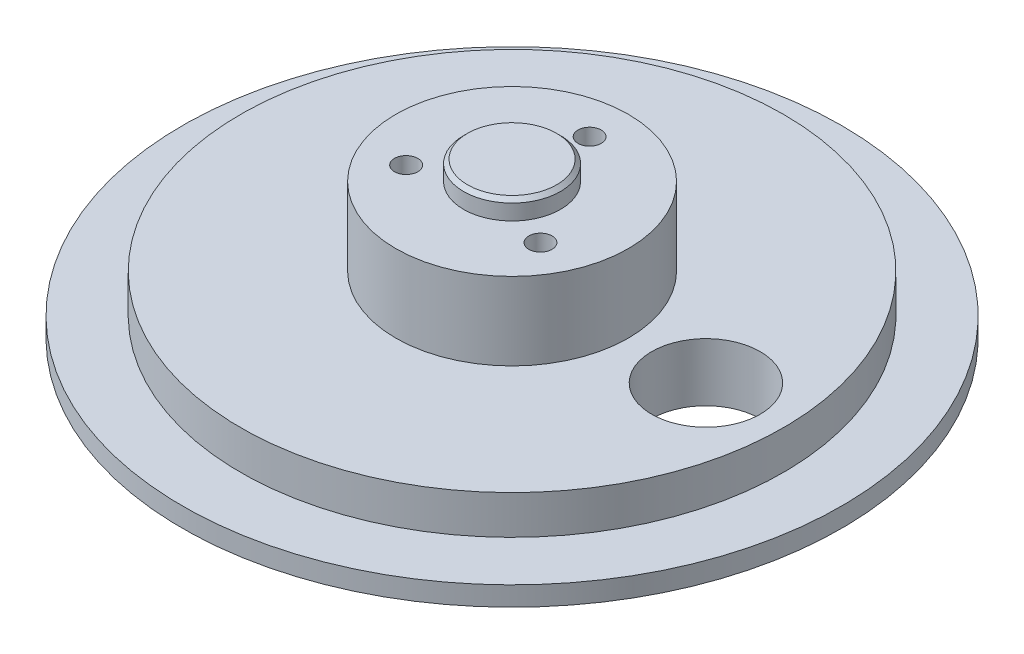
ISO-10303-21;
HEADER;
FILE_DESCRIPTION(('STEP AP214'),'2;1');
FILE_NAME('part.step','',(''),(''),'','','');
FILE_SCHEMA(('AUTOMOTIVE_DESIGN { 1 0 10303 214 1 1 1 1 }'));
ENDSEC;
DATA;
#1=APPLICATION_CONTEXT('core data for automotive mechanical design processes');
#2=APPLICATION_PROTOCOL_DEFINITION('international standard','automotive_design',2000,#1);
#3=PRODUCT_CONTEXT('',#1,'mechanical');
#4=PRODUCT('Part','Part','',(#3));
#5=PRODUCT_RELATED_PRODUCT_CATEGORY('part','',(#4));
#6=PRODUCT_DEFINITION_FORMATION('','',#4);
#7=PRODUCT_DEFINITION_CONTEXT('part definition',#1,'design');
#8=PRODUCT_DEFINITION('design','',#6,#7);
#9=PRODUCT_DEFINITION_SHAPE('','',#8);
#10=(LENGTH_UNIT() NAMED_UNIT(*) SI_UNIT(.MILLI.,.METRE.));
#11=(NAMED_UNIT(*) PLANE_ANGLE_UNIT() SI_UNIT($,.RADIAN.));
#12=(NAMED_UNIT(*) SI_UNIT($,.STERADIAN.) SOLID_ANGLE_UNIT());
#13=UNCERTAINTY_MEASURE_WITH_UNIT(LENGTH_MEASURE(1.E-05),#10,'distance_accuracy_value','');
#14=(GEOMETRIC_REPRESENTATION_CONTEXT(3) GLOBAL_UNCERTAINTY_ASSIGNED_CONTEXT((#13)) GLOBAL_UNIT_ASSIGNED_CONTEXT((#10,
#11,#12)) REPRESENTATION_CONTEXT('',''));
#15=CARTESIAN_POINT('',(0.,0.,0.));
#16=DIRECTION('',(0.,0.,1.));
#17=DIRECTION('',(1.,0.,0.));
#18=AXIS2_PLACEMENT_3D('',#15,#16,#17);
#19=CARTESIAN_POINT('',(0.,35.,0.));
#20=DIRECTION('',(0.,1.,0.));
#21=DIRECTION('',(0.,0.,1.));
#22=AXIS2_PLACEMENT_3D('',#19,#20,#21);
#23=PLANE('',#22);
#24=CARTESIAN_POINT('',(-17.3205080756879,35.,10.0000000000005));
#25=DIRECTION('',(0.,1.,0.));
#26=DIRECTION('',(0.,0.,1.));
#27=AXIS2_PLACEMENT_3D('',#24,#25,#26);
#28=CIRCLE('',#27,3.00000000000113);
#29=CARTESIAN_POINT('',(-17.3205080756879,35.,13.0000000000016));
#30=VERTEX_POINT('',#29);
#31=EDGE_CURVE('E86',#30,#30,#28,.T.);
#32=ORIENTED_EDGE('',*,*,#31,.F.);
#33=EDGE_LOOP('',(#32));
#34=FACE_BOUND('',#33,.T.);
#35=CARTESIAN_POINT('',(17.3205080756896,35.,9.99999999999951));
#36=DIRECTION('',(0.,1.,0.));
#37=DIRECTION('',(0.,0.,1.));
#38=AXIS2_PLACEMENT_3D('',#35,#36,#37);
#39=CIRCLE('',#38,3.00000000000076);
#40=CARTESIAN_POINT('',(17.3205080756896,35.,13.0000000000003));
#41=VERTEX_POINT('',#40);
#42=EDGE_CURVE('E80',#41,#41,#39,.T.);
#43=ORIENTED_EDGE('',*,*,#42,.F.);
#44=EDGE_LOOP('',(#43));
#45=FACE_BOUND('',#44,.T.);
#46=CARTESIAN_POINT('',(0.,35.,-20.));
#47=DIRECTION('',(0.,1.,0.));
#48=DIRECTION('',(0.,0.,1.));
#49=AXIS2_PLACEMENT_3D('',#46,#47,#48);
#50=CIRCLE('',#49,3.);
#51=CARTESIAN_POINT('',(0.,35.,-17.));
#52=VERTEX_POINT('',#51);
#53=EDGE_CURVE('E74',#52,#52,#50,.T.);
#54=ORIENTED_EDGE('',*,*,#53,.F.);
#55=EDGE_LOOP('',(#54));
#56=FACE_BOUND('',#55,.T.);
#57=CARTESIAN_POINT('',(0.,35.,0.));
#58=DIRECTION('',(0.,1.,0.));
#59=DIRECTION('',(0.,0.,1.));
#60=AXIS2_PLACEMENT_3D('',#57,#58,#59);
#61=CIRCLE('',#60,30.);
#62=CARTESIAN_POINT('',(0.,35.,30.));
#63=VERTEX_POINT('',#62);
#64=EDGE_CURVE('E67',#63,#63,#61,.T.);
#65=ORIENTED_EDGE('',*,*,#64,.T.);
#66=EDGE_LOOP('',(#65));
#67=FACE_BOUND('',#66,.T.);
#68=CARTESIAN_POINT('',(0.,35.,0.));
#69=DIRECTION('',(0.,1.,0.));
#70=DIRECTION('',(0.,0.,1.));
#71=AXIS2_PLACEMENT_3D('',#68,#69,#70);
#72=CIRCLE('',#71,12.5);
#73=CARTESIAN_POINT('',(0.,35.,12.5));
#74=VERTEX_POINT('',#73);
#75=EDGE_CURVE('E70',#74,#74,#72,.T.);
#76=ORIENTED_EDGE('',*,*,#75,.F.);
#77=EDGE_LOOP('',(#76));
#78=FACE_BOUND('',#77,.T.);
#79=ADVANCED_FACE('F32',(#34,#45,#56,#67,#78),#23,.T.);
#80=CARTESIAN_POINT('',(-70.,15.,0.));
#81=DIRECTION('',(0.,-1.,0.));
#82=DIRECTION('',(0.,0.,-1.));
#83=AXIS2_PLACEMENT_3D('',#80,#81,#82);
#84=PLANE('',#83);
#85=CARTESIAN_POINT('',(50.,15.,0.));
#86=DIRECTION('',(0.,-1.,0.));
#87=DIRECTION('',(0.,0.,-1.));
#88=AXIS2_PLACEMENT_3D('',#85,#86,#87);
#89=CIRCLE('',#88,14.);
#90=CARTESIAN_POINT('',(50.,15.,-14.));
#91=VERTEX_POINT('',#90);
#92=EDGE_CURVE('E61',#91,#91,#89,.F.);
#93=ORIENTED_EDGE('',*,*,#92,.F.);
#94=EDGE_LOOP('',(#93));
#95=FACE_BOUND('',#94,.T.);
#96=CARTESIAN_POINT('',(0.,15.,0.));
#97=DIRECTION('',(0.,-1.,0.));
#98=DIRECTION('',(0.,0.,-1.));
#99=AXIS2_PLACEMENT_3D('',#96,#97,#98);
#100=CIRCLE('',#99,70.);
#101=CARTESIAN_POINT('',(0.,15.,-70.));
#102=VERTEX_POINT('',#101);
#103=EDGE_CURVE('E47',#102,#102,#100,.T.);
#104=ORIENTED_EDGE('',*,*,#103,.F.);
#105=EDGE_LOOP('',(#104));
#106=FACE_BOUND('',#105,.T.);
#107=CARTESIAN_POINT('',(0.,15.,0.));
#108=DIRECTION('',(0.,-1.,0.));
#109=DIRECTION('',(0.,0.,-1.));
#110=AXIS2_PLACEMENT_3D('',#107,#108,#109);
#111=CIRCLE('',#110,30.);
#112=CARTESIAN_POINT('',(0.,15.,-30.));
#113=VERTEX_POINT('',#112);
#114=EDGE_CURVE('E43',#113,#113,#111,.F.);
#115=ORIENTED_EDGE('',*,*,#114,.F.);
#116=EDGE_LOOP('',(#115));
#117=FACE_BOUND('',#116,.T.);
#118=ADVANCED_FACE('F103',(#95,#106,#117),#84,.F.);
#119=CARTESIAN_POINT('',(0.,0.,0.));
#120=DIRECTION('',(0.,1.,0.));
#121=DIRECTION('',(0.,0.,1.));
#122=AXIS2_PLACEMENT_3D('',#119,#120,#121);
#123=PLANE('',#122);
#124=CARTESIAN_POINT('',(0.,0.,0.));
#125=DIRECTION('',(0.,-1.,0.));
#126=DIRECTION('',(0.,0.,-1.));
#127=AXIS2_PLACEMENT_3D('',#124,#125,#126);
#128=CIRCLE('',#127,85.);
#129=CARTESIAN_POINT('',(0.,0.,-85.));
#130=VERTEX_POINT('',#129);
#131=EDGE_CURVE('E58',#130,#130,#128,.T.);
#132=ORIENTED_EDGE('',*,*,#131,.T.);
#133=EDGE_LOOP('',(#132));
#134=FACE_BOUND('',#133,.T.);
#135=CARTESIAN_POINT('',(50.,0.,0.));
#136=DIRECTION('',(0.,1.,0.));
#137=DIRECTION('',(0.,0.,1.));
#138=AXIS2_PLACEMENT_3D('',#135,#136,#137);
#139=CIRCLE('',#138,14.);
#140=CARTESIAN_POINT('',(50.,0.,14.));
#141=VERTEX_POINT('',#140);
#142=EDGE_CURVE('E64',#141,#141,#139,.T.);
#143=ORIENTED_EDGE('',*,*,#142,.T.);
#144=EDGE_LOOP('',(#143));
#145=FACE_BOUND('',#144,.T.);
#146=ADVANCED_FACE('F132',(#134,#145),#123,.F.);
#147=CARTESIAN_POINT('',(0.,0.,0.));
#148=DIRECTION('',(0.,-1.,0.));
#149=DIRECTION('',(0.,0.,-1.));
#150=AXIS2_PLACEMENT_3D('',#147,#148,#149);
#151=CYLINDRICAL_SURFACE('',#150,70.);
#152=CARTESIAN_POINT('',(0.,4.99999999999999,0.));
#153=DIRECTION('',(0.,-1.,0.));
#154=DIRECTION('',(0.,0.,-1.));
#155=AXIS2_PLACEMENT_3D('',#152,#153,#154);
#156=CIRCLE('',#155,70.);
#157=CARTESIAN_POINT('',(0.,4.99999999999999,-70.));
#158=VERTEX_POINT('',#157);
#159=EDGE_CURVE('E52',#158,#158,#156,.T.);
#160=ORIENTED_EDGE('',*,*,#159,.F.);
#161=EDGE_LOOP('',(#160));
#162=FACE_BOUND('',#161,.T.);
#163=ORIENTED_EDGE('',*,*,#103,.T.);
#164=EDGE_LOOP('',(#163));
#165=FACE_BOUND('',#164,.T.);
#166=ADVANCED_FACE('F135',(#162,#165),#151,.T.);
#167=CARTESIAN_POINT('',(-85.,4.99999999999999,0.));
#168=DIRECTION('',(0.,-1.,0.));
#169=DIRECTION('',(0.,0.,-1.));
#170=AXIS2_PLACEMENT_3D('',#167,#168,#169);
#171=PLANE('',#170);
#172=CARTESIAN_POINT('',(0.,4.99999999999999,0.));
#173=DIRECTION('',(0.,-1.,0.));
#174=DIRECTION('',(0.,0.,-1.));
#175=AXIS2_PLACEMENT_3D('',#172,#173,#174);
#176=CIRCLE('',#175,85.);
#177=CARTESIAN_POINT('',(0.,4.99999999999999,-85.));
#178=VERTEX_POINT('',#177);
#179=EDGE_CURVE('E55',#178,#178,#176,.T.);
#180=ORIENTED_EDGE('',*,*,#179,.F.);
#181=EDGE_LOOP('',(#180));
#182=FACE_BOUND('',#181,.T.);
#183=ORIENTED_EDGE('',*,*,#159,.T.);
#184=EDGE_LOOP('',(#183));
#185=FACE_BOUND('',#184,.T.);
#186=ADVANCED_FACE('F139',(#182,#185),#171,.F.);
#187=CARTESIAN_POINT('',(0.,0.,0.));
#188=DIRECTION('',(0.,-1.,0.));
#189=DIRECTION('',(0.,0.,-1.));
#190=AXIS2_PLACEMENT_3D('',#187,#188,#189);
#191=CYLINDRICAL_SURFACE('',#190,85.);
#192=ORIENTED_EDGE('',*,*,#131,.F.);
#193=EDGE_LOOP('',(#192));
#194=FACE_BOUND('',#193,.T.);
#195=ORIENTED_EDGE('',*,*,#179,.T.);
#196=EDGE_LOOP('',(#195));
#197=FACE_BOUND('',#196,.T.);
#198=ADVANCED_FACE('F130',(#194,#197),#191,.T.);
#199=CARTESIAN_POINT('',(50.,20.,0.));
#200=DIRECTION('',(0.,-1.,0.));
#201=DIRECTION('',(0.,0.,-1.));
#202=AXIS2_PLACEMENT_3D('',#199,#200,#201);
#203=CYLINDRICAL_SURFACE('',#202,14.);
#204=ORIENTED_EDGE('',*,*,#142,.F.);
#205=EDGE_LOOP('',(#204));
#206=FACE_BOUND('',#205,.T.);
#207=ORIENTED_EDGE('',*,*,#92,.T.);
#208=EDGE_LOOP('',(#207));
#209=FACE_BOUND('',#208,.T.);
#210=ADVANCED_FACE('F123',(#206,#209),#203,.F.);
#211=CARTESIAN_POINT('',(0.,35.,0.));
#212=DIRECTION('',(0.,-1.,0.));
#213=DIRECTION('',(0.,0.,-1.));
#214=AXIS2_PLACEMENT_3D('',#211,#212,#213);
#215=CYLINDRICAL_SURFACE('',#214,30.);
#216=ORIENTED_EDGE('',*,*,#64,.F.);
#217=EDGE_LOOP('',(#216));
#218=FACE_BOUND('',#217,.T.);
#219=ORIENTED_EDGE('',*,*,#114,.T.);
#220=EDGE_LOOP('',(#219));
#221=FACE_BOUND('',#220,.T.);
#222=ADVANCED_FACE('F116',(#218,#221),#215,.T.);
#223=CARTESIAN_POINT('',(0.,40.,0.));
#224=DIRECTION('',(0.,-1.,0.));
#225=DIRECTION('',(0.,0.,-1.));
#226=AXIS2_PLACEMENT_3D('',#223,#224,#225);
#227=CYLINDRICAL_SURFACE('',#226,12.5);
#228=CARTESIAN_POINT('',(0.,39.,0.));
#229=DIRECTION('',(0.,1.,0.));
#230=DIRECTION('',(0.,0.,1.));
#231=AXIS2_PLACEMENT_3D('',#228,#229,#230);
#232=CIRCLE('',#231,12.5);
#233=CARTESIAN_POINT('',(0.,39.,12.5));
#234=VERTEX_POINT('',#233);
#235=EDGE_CURVE('E10',#234,#234,#232,.F.);
#236=ORIENTED_EDGE('',*,*,#235,.T.);
#237=EDGE_LOOP('',(#236));
#238=FACE_BOUND('',#237,.T.);
#239=ORIENTED_EDGE('',*,*,#75,.T.);
#240=EDGE_LOOP('',(#239));
#241=FACE_BOUND('',#240,.T.);
#242=ADVANCED_FACE('F113',(#238,#241),#227,.T.);
#243=CARTESIAN_POINT('',(0.,40.,0.));
#244=DIRECTION('',(0.,1.,0.));
#245=DIRECTION('',(0.,0.,1.));
#246=AXIS2_PLACEMENT_3D('',#243,#244,#245);
#247=PLANE('',#246);
#248=CARTESIAN_POINT('',(0.,40.,0.));
#249=DIRECTION('',(0.,1.,0.));
#250=DIRECTION('',(0.,0.,1.));
#251=AXIS2_PLACEMENT_3D('',#248,#249,#250);
#252=CIRCLE('',#251,11.5);
#253=CARTESIAN_POINT('',(0.,40.,11.5));
#254=VERTEX_POINT('',#253);
#255=EDGE_CURVE('E39',#254,#254,#252,.T.);
#256=ORIENTED_EDGE('',*,*,#255,.T.);
#257=EDGE_LOOP('',(#256));
#258=FACE_BOUND('',#257,.T.);
#259=ADVANCED_FACE('F115',(#258),#247,.T.);
#260=CARTESIAN_POINT('',(0.,40.,0.));
#261=DIRECTION('',(0.,-1.,0.));
#262=DIRECTION('',(0.,0.,-1.));
#263=AXIS2_PLACEMENT_3D('',#260,#261,#262);
#264=CONICAL_SURFACE('',#263,11.5,0.785398163397457);
#265=ORIENTED_EDGE('',*,*,#235,.F.);
#266=EDGE_LOOP('',(#265));
#267=FACE_BOUND('',#266,.T.);
#268=ORIENTED_EDGE('',*,*,#255,.F.);
#269=EDGE_LOOP('',(#268));
#270=FACE_BOUND('',#269,.T.);
#271=ADVANCED_FACE('F34',(#267,#270),#264,.T.);
#272=CARTESIAN_POINT('',(0.,20.,-20.));
#273=DIRECTION('',(0.,1.,0.));
#274=DIRECTION('',(0.,0.,1.));
#275=AXIS2_PLACEMENT_3D('',#272,#273,#274);
#276=CYLINDRICAL_SURFACE('',#275,3.);
#277=CARTESIAN_POINT('',(0.,20.,-20.));
#278=DIRECTION('',(0.,1.,0.));
#279=DIRECTION('',(0.,0.,1.));
#280=AXIS2_PLACEMENT_3D('',#277,#278,#279);
#281=CIRCLE('',#280,3.);
#282=CARTESIAN_POINT('',(0.,20.,-17.));
#283=VERTEX_POINT('',#282);
#284=EDGE_CURVE('E73',#283,#283,#281,.T.);
#285=ORIENTED_EDGE('',*,*,#284,.F.);
#286=EDGE_LOOP('',(#285));
#287=FACE_BOUND('',#286,.T.);
#288=ORIENTED_EDGE('',*,*,#53,.T.);
#289=EDGE_LOOP('',(#288));
#290=FACE_BOUND('',#289,.T.);
#291=ADVANCED_FACE('F203',(#287,#290),#276,.F.);
#292=CARTESIAN_POINT('',(0.,20.,-20.));
#293=DIRECTION('',(0.,1.,0.));
#294=DIRECTION('',(0.,0.,1.));
#295=AXIS2_PLACEMENT_3D('',#292,#293,#294);
#296=PLANE('',#295);
#297=ORIENTED_EDGE('',*,*,#284,.T.);
#298=EDGE_LOOP('',(#297));
#299=FACE_BOUND('',#298,.T.);
#300=ADVANCED_FACE('F214',(#299),#296,.T.);
#301=CARTESIAN_POINT('',(17.3205080756896,20.,9.99999999999951));
#302=DIRECTION('',(0.,1.,0.));
#303=DIRECTION('',(0.,0.,1.));
#304=AXIS2_PLACEMENT_3D('',#301,#302,#303);
#305=CYLINDRICAL_SURFACE('',#304,3.00000000000076);
#306=CARTESIAN_POINT('',(17.3205080756896,20.,9.99999999999951));
#307=DIRECTION('',(0.,1.,0.));
#308=DIRECTION('',(0.,0.,1.));
#309=AXIS2_PLACEMENT_3D('',#306,#307,#308);
#310=CIRCLE('',#309,3.00000000000076);
#311=CARTESIAN_POINT('',(17.3205080756896,20.,13.0000000000003));
#312=VERTEX_POINT('',#311);
#313=EDGE_CURVE('E77',#312,#312,#310,.T.);
#314=ORIENTED_EDGE('',*,*,#313,.F.);
#315=EDGE_LOOP('',(#314));
#316=FACE_BOUND('',#315,.T.);
#317=ORIENTED_EDGE('',*,*,#42,.T.);
#318=EDGE_LOOP('',(#317));
#319=FACE_BOUND('',#318,.T.);
#320=ADVANCED_FACE('F223',(#316,#319),#305,.F.);
#321=CARTESIAN_POINT('',(17.3205080756896,20.,9.99999999999951));
#322=DIRECTION('',(0.,1.,0.));
#323=DIRECTION('',(0.,0.,1.));
#324=AXIS2_PLACEMENT_3D('',#321,#322,#323);
#325=PLANE('',#324);
#326=ORIENTED_EDGE('',*,*,#313,.T.);
#327=EDGE_LOOP('',(#326));
#328=FACE_BOUND('',#327,.T.);
#329=ADVANCED_FACE('F97',(#328),#325,.T.);
#330=CARTESIAN_POINT('',(-17.3205080756879,20.,10.0000000000005));
#331=DIRECTION('',(0.,1.,0.));
#332=DIRECTION('',(0.,0.,1.));
#333=AXIS2_PLACEMENT_3D('',#330,#331,#332);
#334=CYLINDRICAL_SURFACE('',#333,3.00000000000113);
#335=CARTESIAN_POINT('',(-17.3205080756879,20.,10.0000000000005));
#336=DIRECTION('',(0.,1.,0.));
#337=DIRECTION('',(0.,0.,1.));
#338=AXIS2_PLACEMENT_3D('',#335,#336,#337);
#339=CIRCLE('',#338,3.00000000000113);
#340=CARTESIAN_POINT('',(-17.3205080756879,20.,13.0000000000016));
#341=VERTEX_POINT('',#340);
#342=EDGE_CURVE('E83',#341,#341,#339,.T.);
#343=ORIENTED_EDGE('',*,*,#342,.F.);
#344=EDGE_LOOP('',(#343));
#345=FACE_BOUND('',#344,.T.);
#346=ORIENTED_EDGE('',*,*,#31,.T.);
#347=EDGE_LOOP('',(#346));
#348=FACE_BOUND('',#347,.T.);
#349=ADVANCED_FACE('F94',(#345,#348),#334,.F.);
#350=CARTESIAN_POINT('',(-17.3205080756879,20.,10.0000000000005));
#351=DIRECTION('',(0.,1.,0.));
#352=DIRECTION('',(0.,0.,1.));
#353=AXIS2_PLACEMENT_3D('',#350,#351,#352);
#354=PLANE('',#353);
#355=ORIENTED_EDGE('',*,*,#342,.T.);
#356=EDGE_LOOP('',(#355));
#357=FACE_BOUND('',#356,.T.);
#358=ADVANCED_FACE('F92',(#357),#354,.T.);
#359=CLOSED_SHELL('',(#79,#118,#146,#166,#186,#198,#210,#222,#242,#259,#271,#291,#300,#320,#329,
#349,#358));
#360=MANIFOLD_SOLID_BREP('B2',#359);
#361=ADVANCED_BREP_SHAPE_REPRESENTATION('',(#18,#360),#14);
#362=SHAPE_DEFINITION_REPRESENTATION(#9,#361);
ENDSEC;
END-ISO-10303-21;
